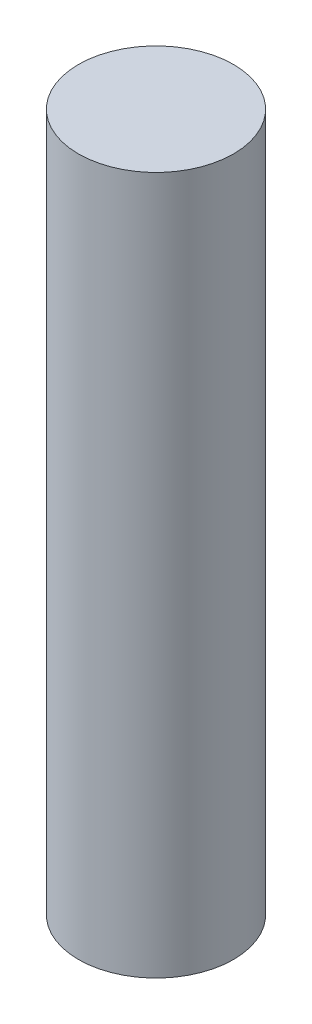
ISO-10303-21;
HEADER;
FILE_DESCRIPTION(('STEP AP214'),'2;1');
FILE_NAME('part.step','',(''),(''),'','','');
FILE_SCHEMA(('AUTOMOTIVE_DESIGN { 1 0 10303 214 1 1 1 1 }'));
ENDSEC;
DATA;
#1=APPLICATION_CONTEXT('core data for automotive mechanical design processes');
#2=APPLICATION_PROTOCOL_DEFINITION('international standard','automotive_design',2000,#1);
#3=PRODUCT_CONTEXT('',#1,'mechanical');
#4=PRODUCT('Part','Part','',(#3));
#5=PRODUCT_RELATED_PRODUCT_CATEGORY('part','',(#4));
#6=PRODUCT_DEFINITION_FORMATION('','',#4);
#7=PRODUCT_DEFINITION_CONTEXT('part definition',#1,'design');
#8=PRODUCT_DEFINITION('design','',#6,#7);
#9=PRODUCT_DEFINITION_SHAPE('','',#8);
#10=(LENGTH_UNIT() NAMED_UNIT(*) SI_UNIT(.MILLI.,.METRE.));
#11=(NAMED_UNIT(*) PLANE_ANGLE_UNIT() SI_UNIT($,.RADIAN.));
#12=(NAMED_UNIT(*) SI_UNIT($,.STERADIAN.) SOLID_ANGLE_UNIT());
#13=UNCERTAINTY_MEASURE_WITH_UNIT(LENGTH_MEASURE(1.E-05),#10,'distance_accuracy_value','');
#14=(GEOMETRIC_REPRESENTATION_CONTEXT(3) GLOBAL_UNCERTAINTY_ASSIGNED_CONTEXT((#13)) GLOBAL_UNIT_ASSIGNED_CONTEXT((#10,
#11,#12)) REPRESENTATION_CONTEXT('',''));
#15=CARTESIAN_POINT('',(0.,0.,0.));
#16=DIRECTION('',(0.,0.,1.));
#17=DIRECTION('',(1.,0.,0.));
#18=AXIS2_PLACEMENT_3D('',#15,#16,#17);
#19=CARTESIAN_POINT('',(0.,114.3,0.));
#20=DIRECTION('',(0.,-1.,0.));
#21=DIRECTION('',(0.,0.,-1.));
#22=AXIS2_PLACEMENT_3D('',#19,#20,#21);
#23=CYLINDRICAL_SURFACE('',#22,12.7);
#24=CARTESIAN_POINT('',(0.,114.3,0.));
#25=DIRECTION('',(0.,1.,0.));
#26=DIRECTION('',(0.,0.,1.));
#27=AXIS2_PLACEMENT_3D('',#24,#25,#26);
#28=CIRCLE('',#27,12.7);
#29=CARTESIAN_POINT('',(0.,114.3,12.7));
#30=VERTEX_POINT('',#29);
#31=EDGE_CURVE('E10',#30,#30,#28,.T.);
#32=ORIENTED_EDGE('',*,*,#31,.F.);
#33=EDGE_LOOP('',(#32));
#34=FACE_BOUND('',#33,.T.);
#35=CARTESIAN_POINT('',(0.,0.,0.));
#36=DIRECTION('',(0.,1.,0.));
#37=DIRECTION('',(0.,0.,1.));
#38=AXIS2_PLACEMENT_3D('',#35,#36,#37);
#39=CIRCLE('',#38,12.7);
#40=CARTESIAN_POINT('',(0.,0.,12.7));
#41=VERTEX_POINT('',#40);
#42=EDGE_CURVE('E40',#41,#41,#39,.T.);
#43=ORIENTED_EDGE('',*,*,#42,.T.);
#44=EDGE_LOOP('',(#43));
#45=FACE_BOUND('',#44,.T.);
#46=ADVANCED_FACE('F37',(#34,#45),#23,.T.);
#47=CARTESIAN_POINT('',(0.,114.3,0.));
#48=DIRECTION('',(0.,1.,0.));
#49=DIRECTION('',(0.,0.,1.));
#50=AXIS2_PLACEMENT_3D('',#47,#48,#49);
#51=PLANE('',#50);
#52=ORIENTED_EDGE('',*,*,#31,.T.);
#53=EDGE_LOOP('',(#52));
#54=FACE_BOUND('',#53,.T.);
#55=ADVANCED_FACE('F54',(#54),#51,.T.);
#56=CARTESIAN_POINT('',(0.,0.,0.));
#57=DIRECTION('',(0.,1.,0.));
#58=DIRECTION('',(0.,0.,1.));
#59=AXIS2_PLACEMENT_3D('',#56,#57,#58);
#60=PLANE('',#59);
#61=ORIENTED_EDGE('',*,*,#42,.F.);
#62=EDGE_LOOP('',(#61));
#63=FACE_BOUND('',#62,.T.);
#64=ADVANCED_FACE('F52',(#63),#60,.F.);
#65=CLOSED_SHELL('',(#46,#55,#64));
#66=MANIFOLD_SOLID_BREP('B2',#65);
#67=ADVANCED_BREP_SHAPE_REPRESENTATION('',(#18,#66),#14);
#68=SHAPE_DEFINITION_REPRESENTATION(#9,#67);
ENDSEC;
END-ISO-10303-21;
